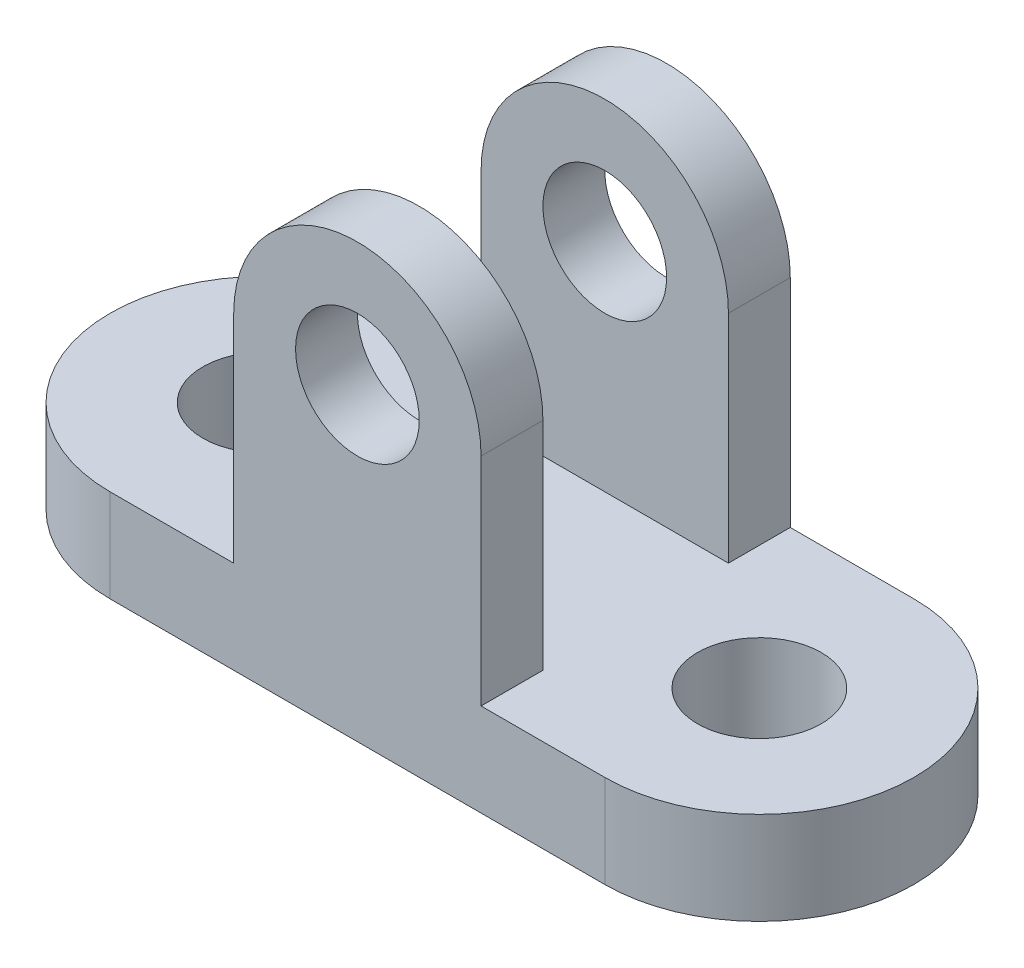
ISO-10303-21;
HEADER;
FILE_DESCRIPTION(('STEP AP214'),'2;1');
FILE_NAME('part.step','',(''),(''),'','','');
FILE_SCHEMA(('AUTOMOTIVE_DESIGN { 1 0 10303 214 1 1 1 1 }'));
ENDSEC;
DATA;
#1=APPLICATION_CONTEXT('core data for automotive mechanical design processes');
#2=APPLICATION_PROTOCOL_DEFINITION('international standard','automotive_design',2000,#1);
#3=PRODUCT_CONTEXT('',#1,'mechanical');
#4=PRODUCT('Part','Part','',(#3));
#5=PRODUCT_RELATED_PRODUCT_CATEGORY('part','',(#4));
#6=PRODUCT_DEFINITION_FORMATION('','',#4);
#7=PRODUCT_DEFINITION_CONTEXT('part definition',#1,'design');
#8=PRODUCT_DEFINITION('design','',#6,#7);
#9=PRODUCT_DEFINITION_SHAPE('','',#8);
#10=(LENGTH_UNIT() NAMED_UNIT(*) SI_UNIT(.MILLI.,.METRE.));
#11=(NAMED_UNIT(*) PLANE_ANGLE_UNIT() SI_UNIT($,.RADIAN.));
#12=(NAMED_UNIT(*) SI_UNIT($,.STERADIAN.) SOLID_ANGLE_UNIT());
#13=UNCERTAINTY_MEASURE_WITH_UNIT(LENGTH_MEASURE(1.E-05),#10,'distance_accuracy_value','');
#14=(GEOMETRIC_REPRESENTATION_CONTEXT(3) GLOBAL_UNCERTAINTY_ASSIGNED_CONTEXT((#13)) GLOBAL_UNIT_ASSIGNED_CONTEXT((#10,
#11,#12)) REPRESENTATION_CONTEXT('',''));
#15=CARTESIAN_POINT('',(0.,0.,0.));
#16=DIRECTION('',(0.,0.,1.));
#17=DIRECTION('',(1.,0.,0.));
#18=AXIS2_PLACEMENT_3D('',#15,#16,#17);
#19=CARTESIAN_POINT('',(0.,15.,25.));
#20=DIRECTION('',(0.,0.,-1.));
#21=DIRECTION('',(-1.,0.,0.));
#22=AXIS2_PLACEMENT_3D('',#19,#20,#21);
#23=PLANE('',#22);
#24=CARTESIAN_POINT('',(40.,50.,25.));
#25=DIRECTION('',(0.,0.,-1.));
#26=DIRECTION('',(-1.,0.,0.));
#27=AXIS2_PLACEMENT_3D('',#24,#25,#26);
#28=CIRCLE('',#27,10.);
#29=CARTESIAN_POINT('',(30.,50.,25.));
#30=VERTEX_POINT('',#29);
#31=EDGE_CURVE('E299',#30,#30,#28,.T.);
#32=ORIENTED_EDGE('',*,*,#31,.T.);
#33=EDGE_LOOP('',(#32));
#34=FACE_BOUND('',#33,.T.);
#35=CARTESIAN_POINT('',(40.,50.,25.));
#36=DIRECTION('',(0.,0.,1.));
#37=DIRECTION('',(1.,0.,0.));
#38=AXIS2_PLACEMENT_3D('',#35,#36,#37);
#39=CIRCLE('',#38,20.);
#40=CARTESIAN_POINT('',(60.,50.,25.));
#41=VERTEX_POINT('',#40);
#42=CARTESIAN_POINT('',(20.,50.,25.));
#43=VERTEX_POINT('',#42);
#44=EDGE_CURVE('E131',#41,#43,#39,.T.);
#45=ORIENTED_EDGE('',*,*,#44,.T.);
#46=DIRECTION('',(0.,-1.,0.));
#47=VECTOR('',#46,1.);
#48=CARTESIAN_POINT('',(20.,70.,25.));
#49=LINE('',#48,#47);
#50=CARTESIAN_POINT('',(20.,15.,25.));
#51=VERTEX_POINT('',#50);
#52=EDGE_CURVE('E316',#43,#51,#49,.T.);
#53=ORIENTED_EDGE('',*,*,#52,.T.);
#54=DIRECTION('',(1.,0.,0.));
#55=VECTOR('',#54,1.);
#56=CARTESIAN_POINT('',(0.,15.,25.));
#57=LINE('',#56,#55);
#58=CARTESIAN_POINT('',(0.,15.,25.));
#59=VERTEX_POINT('',#58);
#60=EDGE_CURVE('E258',#59,#51,#57,.T.);
#61=ORIENTED_EDGE('',*,*,#60,.F.);
#62=DIRECTION('',(0.,-1.,0.));
#63=VECTOR('',#62,1.);
#64=CARTESIAN_POINT('',(0.,15.,25.));
#65=LINE('',#64,#63);
#66=CARTESIAN_POINT('',(0.,0.,25.));
#67=VERTEX_POINT('',#66);
#68=EDGE_CURVE('E138',#59,#67,#65,.T.);
#69=ORIENTED_EDGE('',*,*,#68,.T.);
#70=DIRECTION('',(1.,0.,0.));
#71=VECTOR('',#70,1.);
#72=CARTESIAN_POINT('',(0.,0.,25.));
#73=LINE('',#72,#71);
#74=CARTESIAN_POINT('',(80.,0.,25.));
#75=VERTEX_POINT('',#74);
#76=EDGE_CURVE('E266',#67,#75,#73,.T.);
#77=ORIENTED_EDGE('',*,*,#76,.T.);
#78=DIRECTION('',(0.,-1.,0.));
#79=VECTOR('',#78,1.);
#80=CARTESIAN_POINT('',(80.,15.,25.));
#81=LINE('',#80,#79);
#82=CARTESIAN_POINT('',(80.,15.,25.));
#83=VERTEX_POINT('',#82);
#84=EDGE_CURVE('E283',#83,#75,#81,.T.);
#85=ORIENTED_EDGE('',*,*,#84,.F.);
#86=CARTESIAN_POINT('',(60.,15.,25.));
#87=VERTEX_POINT('',#86);
#88=EDGE_CURVE('E365',#87,#83,#57,.T.);
#89=ORIENTED_EDGE('',*,*,#88,.F.);
#90=DIRECTION('',(0.,-1.,0.));
#91=VECTOR('',#90,1.);
#92=CARTESIAN_POINT('',(60.,70.,25.));
#93=LINE('',#92,#91);
#94=EDGE_CURVE('E319',#41,#87,#93,.T.);
#95=ORIENTED_EDGE('',*,*,#94,.F.);
#96=EDGE_LOOP('',(#45,#53,#61,#69,#77,#85,#89,#95));
#97=FACE_BOUND('',#96,.T.);
#98=ADVANCED_FACE('F127',(#34,#97),#23,.F.);
#99=CARTESIAN_POINT('',(0.,15.,-25.));
#100=DIRECTION('',(0.,0.,1.));
#101=DIRECTION('',(1.,0.,0.));
#102=AXIS2_PLACEMENT_3D('',#99,#100,#101);
#103=PLANE('',#102);
#104=CARTESIAN_POINT('',(40.,50.,-25.));
#105=DIRECTION('',(0.,0.,1.));
#106=DIRECTION('',(1.,0.,0.));
#107=AXIS2_PLACEMENT_3D('',#104,#105,#106);
#108=CIRCLE('',#107,10.);
#109=CARTESIAN_POINT('',(50.,50.,-25.));
#110=VERTEX_POINT('',#109);
#111=EDGE_CURVE('E309',#110,#110,#108,.T.);
#112=ORIENTED_EDGE('',*,*,#111,.T.);
#113=EDGE_LOOP('',(#112));
#114=FACE_BOUND('',#113,.T.);
#115=DIRECTION('',(0.,-1.,0.));
#116=VECTOR('',#115,1.);
#117=CARTESIAN_POINT('',(20.,70.,-25.));
#118=LINE('',#117,#116);
#119=CARTESIAN_POINT('',(20.,50.,-25.));
#120=VERTEX_POINT('',#119);
#121=CARTESIAN_POINT('',(20.,15.,-25.));
#122=VERTEX_POINT('',#121);
#123=EDGE_CURVE('E220',#120,#122,#118,.T.);
#124=ORIENTED_EDGE('',*,*,#123,.F.);
#125=CARTESIAN_POINT('',(40.,50.,-25.));
#126=DIRECTION('',(0.,0.,1.));
#127=DIRECTION('',(1.,0.,0.));
#128=AXIS2_PLACEMENT_3D('',#125,#126,#127);
#129=CIRCLE('',#128,20.);
#130=CARTESIAN_POINT('',(60.,50.,-25.));
#131=VERTEX_POINT('',#130);
#132=EDGE_CURVE('E389',#131,#120,#129,.T.);
#133=ORIENTED_EDGE('',*,*,#132,.F.);
#134=DIRECTION('',(0.,-1.,0.));
#135=VECTOR('',#134,1.);
#136=CARTESIAN_POINT('',(60.,70.,-25.));
#137=LINE('',#136,#135);
#138=CARTESIAN_POINT('',(60.,15.,-25.));
#139=VERTEX_POINT('',#138);
#140=EDGE_CURVE('E231',#131,#139,#137,.T.);
#141=ORIENTED_EDGE('',*,*,#140,.T.);
#142=DIRECTION('',(-1.,0.,0.));
#143=VECTOR('',#142,1.);
#144=CARTESIAN_POINT('',(0.,15.,-25.));
#145=LINE('',#144,#143);
#146=CARTESIAN_POINT('',(80.,15.,-25.));
#147=VERTEX_POINT('',#146);
#148=EDGE_CURVE('E252',#147,#139,#145,.T.);
#149=ORIENTED_EDGE('',*,*,#148,.F.);
#150=DIRECTION('',(0.,-1.,0.));
#151=VECTOR('',#150,1.);
#152=CARTESIAN_POINT('',(80.,15.,-25.));
#153=LINE('',#152,#151);
#154=CARTESIAN_POINT('',(80.,0.,-25.));
#155=VERTEX_POINT('',#154);
#156=EDGE_CURVE('E279',#147,#155,#153,.T.);
#157=ORIENTED_EDGE('',*,*,#156,.T.);
#158=DIRECTION('',(-1.,0.,0.));
#159=VECTOR('',#158,1.);
#160=CARTESIAN_POINT('',(0.,0.,-25.));
#161=LINE('',#160,#159);
#162=CARTESIAN_POINT('',(0.,0.,-25.));
#163=VERTEX_POINT('',#162);
#164=EDGE_CURVE('E273',#155,#163,#161,.T.);
#165=ORIENTED_EDGE('',*,*,#164,.T.);
#166=DIRECTION('',(0.,-1.,0.));
#167=VECTOR('',#166,1.);
#168=CARTESIAN_POINT('',(0.,15.,-25.));
#169=LINE('',#168,#167);
#170=CARTESIAN_POINT('',(0.,15.,-25.));
#171=VERTEX_POINT('',#170);
#172=EDGE_CURVE('E249',#171,#163,#169,.T.);
#173=ORIENTED_EDGE('',*,*,#172,.F.);
#174=EDGE_CURVE('E239',#122,#171,#145,.T.);
#175=ORIENTED_EDGE('',*,*,#174,.F.);
#176=EDGE_LOOP('',(#124,#133,#141,#149,#157,#165,#173,#175));
#177=FACE_BOUND('',#176,.T.);
#178=ADVANCED_FACE('F247',(#114,#177),#103,.F.);
#179=CARTESIAN_POINT('',(20.,70.,-15.));
#180=DIRECTION('',(0.,0.,-1.));
#181=DIRECTION('',(-1.,0.,0.));
#182=AXIS2_PLACEMENT_3D('',#179,#180,#181);
#183=PLANE('',#182);
#184=CARTESIAN_POINT('',(40.,50.,-15.));
#185=DIRECTION('',(0.,0.,-1.));
#186=DIRECTION('',(-1.,0.,0.));
#187=AXIS2_PLACEMENT_3D('',#184,#185,#186);
#188=CIRCLE('',#187,10.);
#189=CARTESIAN_POINT('',(30.,50.,-15.));
#190=VERTEX_POINT('',#189);
#191=EDGE_CURVE('E293',#190,#190,#188,.T.);
#192=ORIENTED_EDGE('',*,*,#191,.T.);
#193=EDGE_LOOP('',(#192));
#194=FACE_BOUND('',#193,.T.);
#195=CARTESIAN_POINT('',(40.,50.,-15.));
#196=DIRECTION('',(0.,0.,-1.));
#197=DIRECTION('',(-1.,0.,0.));
#198=AXIS2_PLACEMENT_3D('',#195,#196,#197);
#199=CIRCLE('',#198,20.);
#200=CARTESIAN_POINT('',(20.,50.,-15.));
#201=VERTEX_POINT('',#200);
#202=CARTESIAN_POINT('',(60.,50.,-15.));
#203=VERTEX_POINT('',#202);
#204=EDGE_CURVE('E301',#201,#203,#199,.T.);
#205=ORIENTED_EDGE('',*,*,#204,.F.);
#206=DIRECTION('',(0.,-1.,0.));
#207=VECTOR('',#206,1.);
#208=CARTESIAN_POINT('',(20.,70.,-15.));
#209=LINE('',#208,#207);
#210=CARTESIAN_POINT('',(20.,15.,-15.));
#211=VERTEX_POINT('',#210);
#212=EDGE_CURVE('E346',#201,#211,#209,.T.);
#213=ORIENTED_EDGE('',*,*,#212,.T.);
#214=DIRECTION('',(1.,0.,0.));
#215=VECTOR('',#214,1.);
#216=CARTESIAN_POINT('',(20.,15.,-15.));
#217=LINE('',#216,#215);
#218=CARTESIAN_POINT('',(60.,15.,-15.));
#219=VERTEX_POINT('',#218);
#220=EDGE_CURVE('E243',#211,#219,#217,.T.);
#221=ORIENTED_EDGE('',*,*,#220,.T.);
#222=DIRECTION('',(0.,-1.,0.));
#223=VECTOR('',#222,1.);
#224=CARTESIAN_POINT('',(60.,70.,-15.));
#225=LINE('',#224,#223);
#226=EDGE_CURVE('E343',#203,#219,#225,.T.);
#227=ORIENTED_EDGE('',*,*,#226,.F.);
#228=EDGE_LOOP('',(#205,#213,#221,#227));
#229=FACE_BOUND('',#228,.T.);
#230=ADVANCED_FACE('F386',(#194,#229),#183,.F.);
#231=CARTESIAN_POINT('',(20.,70.,15.));
#232=DIRECTION('',(0.,0.,1.));
#233=DIRECTION('',(1.,0.,0.));
#234=AXIS2_PLACEMENT_3D('',#231,#232,#233);
#235=PLANE('',#234);
#236=CARTESIAN_POINT('',(40.,50.,15.));
#237=DIRECTION('',(0.,0.,1.));
#238=DIRECTION('',(1.,0.,0.));
#239=AXIS2_PLACEMENT_3D('',#236,#237,#238);
#240=CIRCLE('',#239,10.);
#241=CARTESIAN_POINT('',(50.,50.,15.));
#242=VERTEX_POINT('',#241);
#243=EDGE_CURVE('E290',#242,#242,#240,.T.);
#244=ORIENTED_EDGE('',*,*,#243,.T.);
#245=EDGE_LOOP('',(#244));
#246=FACE_BOUND('',#245,.T.);
#247=DIRECTION('',(0.,-1.,0.));
#248=VECTOR('',#247,1.);
#249=CARTESIAN_POINT('',(20.,70.,15.));
#250=LINE('',#249,#248);
#251=CARTESIAN_POINT('',(20.,50.,15.));
#252=VERTEX_POINT('',#251);
#253=CARTESIAN_POINT('',(20.,15.,15.));
#254=VERTEX_POINT('',#253);
#255=EDGE_CURVE('E324',#252,#254,#250,.T.);
#256=ORIENTED_EDGE('',*,*,#255,.F.);
#257=CARTESIAN_POINT('',(40.,50.,15.));
#258=DIRECTION('',(0.,0.,1.));
#259=DIRECTION('',(1.,0.,0.));
#260=AXIS2_PLACEMENT_3D('',#257,#258,#259);
#261=CIRCLE('',#260,20.);
#262=CARTESIAN_POINT('',(60.,50.,15.));
#263=VERTEX_POINT('',#262);
#264=EDGE_CURVE('E166',#263,#252,#261,.T.);
#265=ORIENTED_EDGE('',*,*,#264,.F.);
#266=DIRECTION('',(0.,-1.,0.));
#267=VECTOR('',#266,1.);
#268=CARTESIAN_POINT('',(60.,70.,15.));
#269=LINE('',#268,#267);
#270=CARTESIAN_POINT('',(60.,15.,15.));
#271=VERTEX_POINT('',#270);
#272=EDGE_CURVE('E146',#263,#271,#269,.T.);
#273=ORIENTED_EDGE('',*,*,#272,.T.);
#274=DIRECTION('',(-1.,0.,0.));
#275=VECTOR('',#274,1.);
#276=CARTESIAN_POINT('',(20.,15.,15.));
#277=LINE('',#276,#275);
#278=EDGE_CURVE('E327',#271,#254,#277,.T.);
#279=ORIENTED_EDGE('',*,*,#278,.T.);
#280=EDGE_LOOP('',(#256,#265,#273,#279));
#281=FACE_BOUND('',#280,.T.);
#282=ADVANCED_FACE('F415',(#246,#281),#235,.F.);
#283=CARTESIAN_POINT('',(20.,70.,-25.));
#284=DIRECTION('',(1.,0.,0.));
#285=DIRECTION('',(0.,0.,-1.));
#286=AXIS2_PLACEMENT_3D('',#283,#284,#285);
#287=PLANE('',#286);
#288=DIRECTION('',(0.,0.,1.));
#289=VECTOR('',#288,1.);
#290=CARTESIAN_POINT('',(20.,50.,-25.));
#291=LINE('',#290,#289);
#292=EDGE_CURVE('E226',#120,#201,#291,.T.);
#293=ORIENTED_EDGE('',*,*,#292,.F.);
#294=ORIENTED_EDGE('',*,*,#123,.T.);
#295=DIRECTION('',(0.,0.,1.));
#296=VECTOR('',#295,1.);
#297=CARTESIAN_POINT('',(20.,15.,-25.));
#298=LINE('',#297,#296);
#299=EDGE_CURVE('E224',#122,#211,#298,.T.);
#300=ORIENTED_EDGE('',*,*,#299,.T.);
#301=ORIENTED_EDGE('',*,*,#212,.F.);
#302=EDGE_LOOP('',(#293,#294,#300,#301));
#303=FACE_BOUND('',#302,.T.);
#304=ADVANCED_FACE('F222',(#303),#287,.F.);
#305=CARTESIAN_POINT('',(20.,70.,25.));
#306=DIRECTION('',(1.,0.,0.));
#307=DIRECTION('',(0.,0.,-1.));
#308=AXIS2_PLACEMENT_3D('',#305,#306,#307);
#309=PLANE('',#308);
#310=DIRECTION('',(0.,0.,1.));
#311=VECTOR('',#310,1.);
#312=CARTESIAN_POINT('',(20.,50.,-25.));
#313=LINE('',#312,#311);
#314=EDGE_CURVE('E12',#252,#43,#313,.T.);
#315=ORIENTED_EDGE('',*,*,#314,.F.);
#316=ORIENTED_EDGE('',*,*,#255,.T.);
#317=DIRECTION('',(0.,0.,1.));
#318=VECTOR('',#317,1.);
#319=CARTESIAN_POINT('',(20.,15.,25.));
#320=LINE('',#319,#318);
#321=EDGE_CURVE('E245',#254,#51,#320,.T.);
#322=ORIENTED_EDGE('',*,*,#321,.T.);
#323=ORIENTED_EDGE('',*,*,#52,.F.);
#324=EDGE_LOOP('',(#315,#316,#322,#323));
#325=FACE_BOUND('',#324,.T.);
#326=ADVANCED_FACE('F439',(#325),#309,.F.);
#327=CARTESIAN_POINT('',(0.,15.,0.));
#328=DIRECTION('',(0.,1.,0.));
#329=DIRECTION('',(0.,0.,1.));
#330=AXIS2_PLACEMENT_3D('',#327,#328,#329);
#331=PLANE('',#330);
#332=CARTESIAN_POINT('',(0.,15.,0.));
#333=DIRECTION('',(0.,1.,0.));
#334=DIRECTION('',(0.,0.,1.));
#335=AXIS2_PLACEMENT_3D('',#332,#333,#334);
#336=CIRCLE('',#335,10.);
#337=CARTESIAN_POINT('',(0.,15.,10.));
#338=VERTEX_POINT('',#337);
#339=EDGE_CURVE('E353',#338,#338,#336,.T.);
#340=ORIENTED_EDGE('',*,*,#339,.F.);
#341=EDGE_LOOP('',(#340));
#342=FACE_BOUND('',#341,.T.);
#343=CARTESIAN_POINT('',(80.,15.,0.));
#344=DIRECTION('',(0.,1.,0.));
#345=DIRECTION('',(0.,0.,-1.));
#346=AXIS2_PLACEMENT_3D('',#343,#344,#345);
#347=CIRCLE('',#346,9.99999999999999);
#348=CARTESIAN_POINT('',(80.,15.,-9.99999999999999));
#349=VERTEX_POINT('',#348);
#350=EDGE_CURVE('E357',#349,#349,#347,.T.);
#351=ORIENTED_EDGE('',*,*,#350,.F.);
#352=EDGE_LOOP('',(#351));
#353=FACE_BOUND('',#352,.T.);
#354=ORIENTED_EDGE('',*,*,#60,.T.);
#355=ORIENTED_EDGE('',*,*,#321,.F.);
#356=ORIENTED_EDGE('',*,*,#278,.F.);
#357=DIRECTION('',(0.,0.,-1.));
#358=VECTOR('',#357,1.);
#359=CARTESIAN_POINT('',(60.,15.,25.));
#360=LINE('',#359,#358);
#361=EDGE_CURVE('E330',#87,#271,#360,.T.);
#362=ORIENTED_EDGE('',*,*,#361,.F.);
#363=ORIENTED_EDGE('',*,*,#88,.T.);
#364=CARTESIAN_POINT('',(80.,15.,0.));
#365=DIRECTION('',(0.,1.,0.));
#366=DIRECTION('',(0.,0.,1.));
#367=AXIS2_PLACEMENT_3D('',#364,#365,#366);
#368=CIRCLE('',#367,25.);
#369=EDGE_CURVE('E253',#83,#147,#368,.T.);
#370=ORIENTED_EDGE('',*,*,#369,.T.);
#371=ORIENTED_EDGE('',*,*,#148,.T.);
#372=DIRECTION('',(0.,0.,-1.));
#373=VECTOR('',#372,1.);
#374=CARTESIAN_POINT('',(60.,15.,-25.));
#375=LINE('',#374,#373);
#376=EDGE_CURVE('E232',#219,#139,#375,.T.);
#377=ORIENTED_EDGE('',*,*,#376,.F.);
#378=ORIENTED_EDGE('',*,*,#220,.F.);
#379=ORIENTED_EDGE('',*,*,#299,.F.);
#380=ORIENTED_EDGE('',*,*,#174,.T.);
#381=CARTESIAN_POINT('',(0.,15.,0.));
#382=DIRECTION('',(0.,1.,0.));
#383=DIRECTION('',(0.,0.,1.));
#384=AXIS2_PLACEMENT_3D('',#381,#382,#383);
#385=CIRCLE('',#384,25.);
#386=EDGE_CURVE('E276',#171,#59,#385,.T.);
#387=ORIENTED_EDGE('',*,*,#386,.T.);
#388=EDGE_LOOP('',(#354,#355,#356,#362,#363,#370,#371,#377,#378,#379,#380,#387));
#389=FACE_BOUND('',#388,.T.);
#390=ADVANCED_FACE('F237',(#342,#353,#389),#331,.T.);
#391=CARTESIAN_POINT('',(0.,15.,0.));
#392=DIRECTION('',(0.,-1.,0.));
#393=DIRECTION('',(0.,0.,-1.));
#394=AXIS2_PLACEMENT_3D('',#391,#392,#393);
#395=CYLINDRICAL_SURFACE('',#394,25.);
#396=CARTESIAN_POINT('',(0.,0.,0.));
#397=DIRECTION('',(0.,1.,0.));
#398=DIRECTION('',(0.,0.,1.));
#399=AXIS2_PLACEMENT_3D('',#396,#397,#398);
#400=CIRCLE('',#399,25.);
#401=EDGE_CURVE('E262',#163,#67,#400,.T.);
#402=ORIENTED_EDGE('',*,*,#401,.T.);
#403=ORIENTED_EDGE('',*,*,#68,.F.);
#404=ORIENTED_EDGE('',*,*,#386,.F.);
#405=ORIENTED_EDGE('',*,*,#172,.T.);
#406=EDGE_LOOP('',(#402,#403,#404,#405));
#407=FACE_BOUND('',#406,.T.);
#408=ADVANCED_FACE('F129',(#407),#395,.T.);
#409=CARTESIAN_POINT('',(80.,15.,0.));
#410=DIRECTION('',(0.,-1.,0.));
#411=DIRECTION('',(0.,0.,-1.));
#412=AXIS2_PLACEMENT_3D('',#409,#410,#411);
#413=CYLINDRICAL_SURFACE('',#412,25.);
#414=CARTESIAN_POINT('',(80.,0.,0.));
#415=DIRECTION('',(0.,1.,0.));
#416=DIRECTION('',(0.,0.,1.));
#417=AXIS2_PLACEMENT_3D('',#414,#415,#416);
#418=CIRCLE('',#417,25.);
#419=EDGE_CURVE('E270',#75,#155,#418,.T.);
#420=ORIENTED_EDGE('',*,*,#419,.T.);
#421=ORIENTED_EDGE('',*,*,#156,.F.);
#422=ORIENTED_EDGE('',*,*,#369,.F.);
#423=ORIENTED_EDGE('',*,*,#84,.T.);
#424=EDGE_LOOP('',(#420,#421,#422,#423));
#425=FACE_BOUND('',#424,.T.);
#426=ADVANCED_FACE('F377',(#425),#413,.T.);
#427=CARTESIAN_POINT('',(0.,0.,0.));
#428=DIRECTION('',(0.,1.,0.));
#429=DIRECTION('',(0.,0.,1.));
#430=AXIS2_PLACEMENT_3D('',#427,#428,#429);
#431=PLANE('',#430);
#432=CARTESIAN_POINT('',(0.,0.,0.));
#433=DIRECTION('',(0.,1.,0.));
#434=DIRECTION('',(0.,0.,1.));
#435=AXIS2_PLACEMENT_3D('',#432,#433,#434);
#436=CIRCLE('',#435,10.);
#437=CARTESIAN_POINT('',(0.,0.,10.));
#438=VERTEX_POINT('',#437);
#439=EDGE_CURVE('E267',#438,#438,#436,.T.);
#440=ORIENTED_EDGE('',*,*,#439,.T.);
#441=EDGE_LOOP('',(#440));
#442=FACE_BOUND('',#441,.T.);
#443=CARTESIAN_POINT('',(80.,0.,0.));
#444=DIRECTION('',(0.,1.,0.));
#445=DIRECTION('',(0.,0.,-1.));
#446=AXIS2_PLACEMENT_3D('',#443,#444,#445);
#447=CIRCLE('',#446,9.99999999999999);
#448=CARTESIAN_POINT('',(80.,0.,-9.99999999999999));
#449=VERTEX_POINT('',#448);
#450=EDGE_CURVE('E349',#449,#449,#447,.T.);
#451=ORIENTED_EDGE('',*,*,#450,.T.);
#452=EDGE_LOOP('',(#451));
#453=FACE_BOUND('',#452,.T.);
#454=ORIENTED_EDGE('',*,*,#401,.F.);
#455=ORIENTED_EDGE('',*,*,#164,.F.);
#456=ORIENTED_EDGE('',*,*,#419,.F.);
#457=ORIENTED_EDGE('',*,*,#76,.F.);
#458=EDGE_LOOP('',(#454,#455,#456,#457));
#459=FACE_BOUND('',#458,.T.);
#460=ADVANCED_FACE('F431',(#442,#453,#459),#431,.F.);
#461=CARTESIAN_POINT('',(80.,0.,0.));
#462=DIRECTION('',(0.,1.,0.));
#463=DIRECTION('',(0.,0.,1.));
#464=AXIS2_PLACEMENT_3D('',#461,#462,#463);
#465=CYLINDRICAL_SURFACE('',#464,9.99999999999999);
#466=ORIENTED_EDGE('',*,*,#450,.F.);
#467=EDGE_LOOP('',(#466));
#468=FACE_BOUND('',#467,.T.);
#469=ORIENTED_EDGE('',*,*,#350,.T.);
#470=EDGE_LOOP('',(#469));
#471=FACE_BOUND('',#470,.T.);
#472=ADVANCED_FACE('F435',(#468,#471),#465,.F.);
#473=CARTESIAN_POINT('',(0.,0.,0.));
#474=DIRECTION('',(0.,1.,0.));
#475=DIRECTION('',(0.,0.,1.));
#476=AXIS2_PLACEMENT_3D('',#473,#474,#475);
#477=CYLINDRICAL_SURFACE('',#476,10.);
#478=ORIENTED_EDGE('',*,*,#439,.F.);
#479=EDGE_LOOP('',(#478));
#480=FACE_BOUND('',#479,.T.);
#481=ORIENTED_EDGE('',*,*,#339,.T.);
#482=EDGE_LOOP('',(#481));
#483=FACE_BOUND('',#482,.T.);
#484=ADVANCED_FACE('F443',(#480,#483),#477,.F.);
#485=CARTESIAN_POINT('',(60.,70.,-25.));
#486=DIRECTION('',(-1.,0.,0.));
#487=DIRECTION('',(0.,0.,1.));
#488=AXIS2_PLACEMENT_3D('',#485,#486,#487);
#489=PLANE('',#488);
#490=ORIENTED_EDGE('',*,*,#140,.F.);
#491=DIRECTION('',(0.,0.,1.));
#492=VECTOR('',#491,1.);
#493=CARTESIAN_POINT('',(60.,50.,-25.));
#494=LINE('',#493,#492);
#495=EDGE_CURVE('E384',#131,#203,#494,.T.);
#496=ORIENTED_EDGE('',*,*,#495,.T.);
#497=ORIENTED_EDGE('',*,*,#226,.T.);
#498=ORIENTED_EDGE('',*,*,#376,.T.);
#499=EDGE_LOOP('',(#490,#496,#497,#498));
#500=FACE_BOUND('',#499,.T.);
#501=ADVANCED_FACE('F382',(#500),#489,.F.);
#502=CARTESIAN_POINT('',(60.,70.,25.));
#503=DIRECTION('',(-1.,0.,0.));
#504=DIRECTION('',(0.,0.,1.));
#505=AXIS2_PLACEMENT_3D('',#502,#503,#504);
#506=PLANE('',#505);
#507=ORIENTED_EDGE('',*,*,#272,.F.);
#508=EDGE_CURVE('E393',#263,#41,#494,.T.);
#509=ORIENTED_EDGE('',*,*,#508,.T.);
#510=ORIENTED_EDGE('',*,*,#94,.T.);
#511=ORIENTED_EDGE('',*,*,#361,.T.);
#512=EDGE_LOOP('',(#507,#509,#510,#511));
#513=FACE_BOUND('',#512,.T.);
#514=ADVANCED_FACE('F457',(#513),#506,.F.);
#515=CARTESIAN_POINT('',(40.,50.,-25.));
#516=DIRECTION('',(0.,0.,1.));
#517=DIRECTION('',(1.,0.,0.));
#518=AXIS2_PLACEMENT_3D('',#515,#516,#517);
#519=CYLINDRICAL_SURFACE('',#518,20.);
#520=ORIENTED_EDGE('',*,*,#44,.F.);
#521=ORIENTED_EDGE('',*,*,#508,.F.);
#522=ORIENTED_EDGE('',*,*,#264,.T.);
#523=ORIENTED_EDGE('',*,*,#314,.T.);
#524=EDGE_LOOP('',(#520,#521,#522,#523));
#525=FACE_BOUND('',#524,.T.);
#526=ADVANCED_FACE('F459',(#525),#519,.T.);
#527=CARTESIAN_POINT('',(40.,50.,-25.));
#528=DIRECTION('',(0.,0.,1.));
#529=DIRECTION('',(1.,0.,0.));
#530=AXIS2_PLACEMENT_3D('',#527,#528,#529);
#531=CYLINDRICAL_SURFACE('',#530,10.);
#532=ORIENTED_EDGE('',*,*,#243,.F.);
#533=EDGE_LOOP('',(#532));
#534=FACE_BOUND('',#533,.T.);
#535=ORIENTED_EDGE('',*,*,#31,.F.);
#536=EDGE_LOOP('',(#535));
#537=FACE_BOUND('',#536,.T.);
#538=ADVANCED_FACE('F411',(#534,#537),#531,.F.);
#539=ORIENTED_EDGE('',*,*,#204,.T.);
#540=ORIENTED_EDGE('',*,*,#495,.F.);
#541=ORIENTED_EDGE('',*,*,#132,.T.);
#542=ORIENTED_EDGE('',*,*,#292,.T.);
#543=EDGE_LOOP('',(#539,#540,#541,#542));
#544=FACE_BOUND('',#543,.T.);
#545=ADVANCED_FACE('F388',(#544),#519,.T.);
#546=ORIENTED_EDGE('',*,*,#111,.F.);
#547=EDGE_LOOP('',(#546));
#548=FACE_BOUND('',#547,.T.);
#549=ORIENTED_EDGE('',*,*,#191,.F.);
#550=EDGE_LOOP('',(#549));
#551=FACE_BOUND('',#550,.T.);
#552=ADVANCED_FACE('F407',(#548,#551),#531,.F.);
#553=CLOSED_SHELL('',(#98,#178,#230,#282,#304,#326,#390,#408,#426,#460,#472,#484,#501,#514,#526,
#538,#545,#552));
#554=MANIFOLD_SOLID_BREP('B2',#553);
#555=ADVANCED_BREP_SHAPE_REPRESENTATION('',(#18,#554),#14);
#556=SHAPE_DEFINITION_REPRESENTATION(#9,#555);
ENDSEC;
END-ISO-10303-21;
